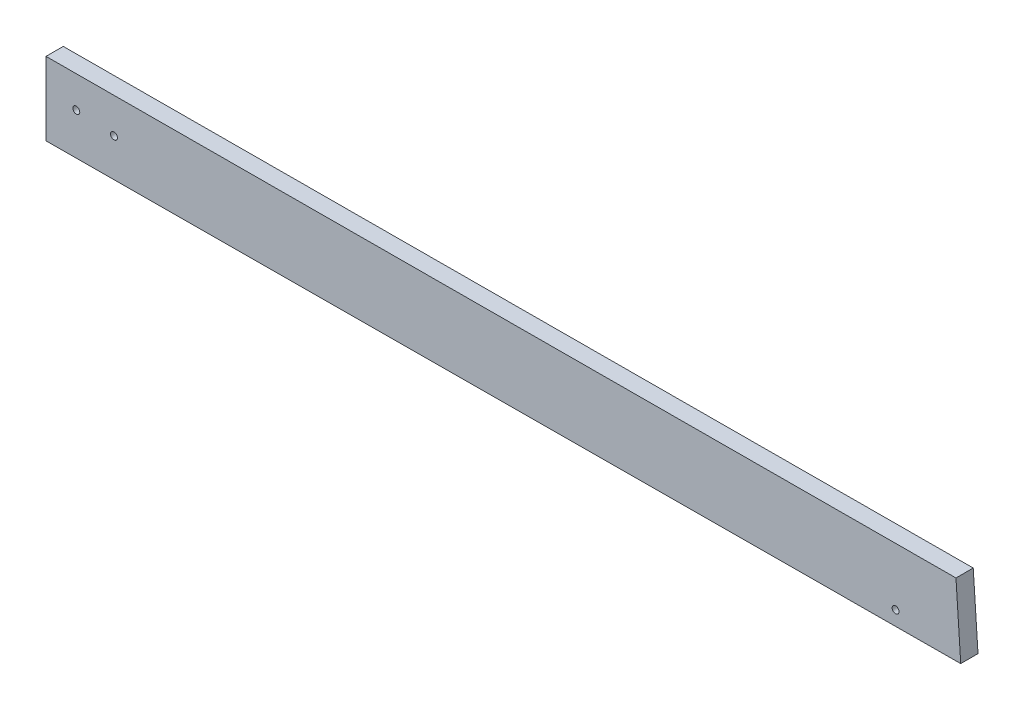
ISO-10303-21;
HEADER;
FILE_DESCRIPTION(('STEP AP214'),'2;1');
FILE_NAME('part.step','',(''),(''),'','','');
FILE_SCHEMA(('AUTOMOTIVE_DESIGN { 1 0 10303 214 1 1 1 1 }'));
ENDSEC;
DATA;
#1=APPLICATION_CONTEXT('core data for automotive mechanical design processes');
#2=APPLICATION_PROTOCOL_DEFINITION('international standard','automotive_design',2000,#1);
#3=PRODUCT_CONTEXT('',#1,'mechanical');
#4=PRODUCT('Part','Part','',(#3));
#5=PRODUCT_RELATED_PRODUCT_CATEGORY('part','',(#4));
#6=PRODUCT_DEFINITION_FORMATION('','',#4);
#7=PRODUCT_DEFINITION_CONTEXT('part definition',#1,'design');
#8=PRODUCT_DEFINITION('design','',#6,#7);
#9=PRODUCT_DEFINITION_SHAPE('','',#8);
#10=(LENGTH_UNIT() NAMED_UNIT(*) SI_UNIT(.MILLI.,.METRE.));
#11=(NAMED_UNIT(*) PLANE_ANGLE_UNIT() SI_UNIT($,.RADIAN.));
#12=(NAMED_UNIT(*) SI_UNIT($,.STERADIAN.) SOLID_ANGLE_UNIT());
#13=UNCERTAINTY_MEASURE_WITH_UNIT(LENGTH_MEASURE(1.E-05),#10,'distance_accuracy_value','');
#14=(GEOMETRIC_REPRESENTATION_CONTEXT(3) GLOBAL_UNCERTAINTY_ASSIGNED_CONTEXT((#13)) GLOBAL_UNIT_ASSIGNED_CONTEXT((#10,
#11,#12)) REPRESENTATION_CONTEXT('',''));
#15=CARTESIAN_POINT('',(0.,0.,0.));
#16=DIRECTION('',(0.,0.,1.));
#17=DIRECTION('',(1.,0.,0.));
#18=AXIS2_PLACEMENT_3D('',#15,#16,#17);
#19=CARTESIAN_POINT('',(-0.640024251142575,125.783223858887,-3.175));
#20=DIRECTION('',(-0.00508824584281917,0.999987054793332,0.));
#21=DIRECTION('',(-0.999987054793332,-0.00508824584281917,0.));
#22=AXIS2_PLACEMENT_3D('',#19,#20,#21);
#23=PLANE('',#22);
#24=DIRECTION('',(-0.999987054793332,-0.00508824584281917,0.));
#25=VECTOR('',#24,1.);
#26=CARTESIAN_POINT('',(-0.640024251142575,125.783223858887,0.));
#27=LINE('',#26,#25);
#28=CARTESIAN_POINT('',(169.876910837737,126.650867176805,0.));
#29=VERTEX_POINT('',#28);
#30=CARTESIAN_POINT('',(1.5875,125.794558196623,0.));
#31=VERTEX_POINT('',#30);
#32=EDGE_CURVE('E111',#29,#31,#27,.T.);
#33=ORIENTED_EDGE('',*,*,#32,.T.);
#34=DIRECTION('',(0.,0.,1.));
#35=VECTOR('',#34,1.);
#36=CARTESIAN_POINT('',(1.5875,125.794558196623,-3.175));
#37=LINE('',#36,#35);
#38=CARTESIAN_POINT('',(1.5875,125.794558196623,-3.175));
#39=VERTEX_POINT('',#38);
#40=EDGE_CURVE('E11',#39,#31,#37,.T.);
#41=ORIENTED_EDGE('',*,*,#40,.F.);
#42=DIRECTION('',(-0.999987054793332,-0.00508824584281917,0.));
#43=VECTOR('',#42,1.);
#44=CARTESIAN_POINT('',(-0.640024251142575,125.783223858887,-3.175));
#45=LINE('',#44,#43);
#46=CARTESIAN_POINT('',(169.876910837737,126.650867176805,-3.175));
#47=VERTEX_POINT('',#46);
#48=EDGE_CURVE('E95',#47,#39,#45,.T.);
#49=ORIENTED_EDGE('',*,*,#48,.F.);
#50=DIRECTION('',(0.,0.,1.));
#51=VECTOR('',#50,1.);
#52=CARTESIAN_POINT('',(169.876910837737,126.650867176805,-3.175));
#53=LINE('',#52,#51);
#54=EDGE_CURVE('E39',#47,#29,#53,.T.);
#55=ORIENTED_EDGE('',*,*,#54,.T.);
#56=EDGE_LOOP('',(#33,#41,#49,#55));
#57=FACE_BOUND('',#56,.T.);
#58=ADVANCED_FACE('F35',(#57),#23,.F.);
#59=CARTESIAN_POINT('',(1.5875,0.,-3.175));
#60=DIRECTION('',(1.,0.,0.));
#61=DIRECTION('',(0.,1.,0.));
#62=AXIS2_PLACEMENT_3D('',#59,#60,#61);
#63=PLANE('',#62);
#64=DIRECTION('',(0.,1.,0.));
#65=VECTOR('',#64,1.);
#66=CARTESIAN_POINT('',(1.5875,0.,0.));
#67=LINE('',#66,#65);
#68=CARTESIAN_POINT('',(1.5875,139.257710065147,0.));
#69=VERTEX_POINT('',#68);
#70=EDGE_CURVE('E67',#31,#69,#67,.T.);
#71=ORIENTED_EDGE('',*,*,#70,.T.);
#72=DIRECTION('',(0.,0.,1.));
#73=VECTOR('',#72,1.);
#74=CARTESIAN_POINT('',(1.5875,139.257710065147,-3.175));
#75=LINE('',#74,#73);
#76=CARTESIAN_POINT('',(1.5875,139.257710065147,-3.175));
#77=VERTEX_POINT('',#76);
#78=EDGE_CURVE('E45',#77,#69,#75,.T.);
#79=ORIENTED_EDGE('',*,*,#78,.F.);
#80=DIRECTION('',(0.,1.,0.));
#81=VECTOR('',#80,1.);
#82=CARTESIAN_POINT('',(1.5875,0.,-3.175));
#83=LINE('',#82,#81);
#84=EDGE_CURVE('E53',#39,#77,#83,.T.);
#85=ORIENTED_EDGE('',*,*,#84,.F.);
#86=ORIENTED_EDGE('',*,*,#40,.T.);
#87=EDGE_LOOP('',(#71,#79,#85,#86));
#88=FACE_BOUND('',#87,.T.);
#89=ADVANCED_FACE('F122',(#88),#63,.F.);
#90=CARTESIAN_POINT('',(-0.499869803452931,139.250216984304,-3.175));
#91=DIRECTION('',(0.00358970056650048,-0.999993557004165,0.));
#92=DIRECTION('',(0.999993557004165,0.00358970056650048,0.));
#93=AXIS2_PLACEMENT_3D('',#90,#91,#92);
#94=PLANE('',#93);
#95=DIRECTION('',(0.999993557004165,0.00358970056650048,0.));
#96=VECTOR('',#95,1.);
#97=CARTESIAN_POINT('',(-0.499869803452931,139.250216984304,0.));
#98=LINE('',#97,#96);
#99=CARTESIAN_POINT('',(169.000191681547,139.858675371333,0.));
#100=VERTEX_POINT('',#99);
#101=EDGE_CURVE('E89',#69,#100,#98,.T.);
#102=ORIENTED_EDGE('',*,*,#101,.T.);
#103=DIRECTION('',(0.,0.,1.));
#104=VECTOR('',#103,1.);
#105=CARTESIAN_POINT('',(169.000191681547,139.858675371333,-3.175));
#106=LINE('',#105,#104);
#107=CARTESIAN_POINT('',(169.000191681547,139.858675371333,-3.175));
#108=VERTEX_POINT('',#107);
#109=EDGE_CURVE('E87',#108,#100,#106,.T.);
#110=ORIENTED_EDGE('',*,*,#109,.F.);
#111=DIRECTION('',(0.999993557004165,0.00358970056650048,0.));
#112=VECTOR('',#111,1.);
#113=CARTESIAN_POINT('',(-0.499869803452931,139.250216984304,-3.175));
#114=LINE('',#113,#112);
#115=EDGE_CURVE('E81',#77,#108,#114,.T.);
#116=ORIENTED_EDGE('',*,*,#115,.F.);
#117=ORIENTED_EDGE('',*,*,#78,.T.);
#118=EDGE_LOOP('',(#102,#110,#116,#117));
#119=FACE_BOUND('',#118,.T.);
#120=ADVANCED_FACE('F88',(#119),#94,.F.);
#121=CARTESIAN_POINT('',(7.16369695098962,133.477415442428,-3.175));
#122=DIRECTION('',(0.,0.,1.));
#123=DIRECTION('',(1.,0.,0.));
#124=AXIS2_PLACEMENT_3D('',#121,#122,#123);
#125=CYLINDRICAL_SURFACE('',#124,0.634999999999996);
#126=CARTESIAN_POINT('',(7.16369695098962,133.477415442428,-3.175));
#127=DIRECTION('',(0.,0.,1.));
#128=DIRECTION('',(1.,0.,0.));
#129=AXIS2_PLACEMENT_3D('',#126,#127,#128);
#130=CIRCLE('',#129,0.634999999999996);
#131=CARTESIAN_POINT('',(7.79869695098961,133.477415442428,-3.175));
#132=VERTEX_POINT('',#131);
#133=EDGE_CURVE('E97',#132,#132,#130,.T.);
#134=ORIENTED_EDGE('',*,*,#133,.F.);
#135=EDGE_LOOP('',(#134));
#136=FACE_BOUND('',#135,.T.);
#137=CARTESIAN_POINT('',(7.16369695098962,133.477415442428,0.));
#138=DIRECTION('',(0.,0.,1.));
#139=DIRECTION('',(1.,0.,0.));
#140=AXIS2_PLACEMENT_3D('',#137,#138,#139);
#141=CIRCLE('',#140,0.634999999999996);
#142=CARTESIAN_POINT('',(7.79869695098961,133.477415442428,0.));
#143=VERTEX_POINT('',#142);
#144=EDGE_CURVE('E108',#143,#143,#141,.T.);
#145=ORIENTED_EDGE('',*,*,#144,.T.);
#146=EDGE_LOOP('',(#145));
#147=FACE_BOUND('',#146,.T.);
#148=ADVANCED_FACE('F129',(#136,#147),#125,.F.);
#149=CARTESIAN_POINT('',(14.0875035769668,132.842415442428,-3.175));
#150=DIRECTION('',(0.,0.,1.));
#151=DIRECTION('',(1.,0.,0.));
#152=AXIS2_PLACEMENT_3D('',#149,#150,#151);
#153=CYLINDRICAL_SURFACE('',#152,0.634999999999992);
#154=CARTESIAN_POINT('',(14.0875035769668,132.842415442428,-3.175));
#155=DIRECTION('',(0.,0.,1.));
#156=DIRECTION('',(1.,0.,0.));
#157=AXIS2_PLACEMENT_3D('',#154,#155,#156);
#158=CIRCLE('',#157,0.634999999999992);
#159=CARTESIAN_POINT('',(14.7225035769667,132.842415442428,-3.175));
#160=VERTEX_POINT('',#159);
#161=EDGE_CURVE('E149',#160,#160,#158,.T.);
#162=ORIENTED_EDGE('',*,*,#161,.F.);
#163=EDGE_LOOP('',(#162));
#164=FACE_BOUND('',#163,.T.);
#165=CARTESIAN_POINT('',(14.0875035769668,132.842415442428,0.));
#166=DIRECTION('',(0.,0.,1.));
#167=DIRECTION('',(1.,0.,0.));
#168=AXIS2_PLACEMENT_3D('',#165,#166,#167);
#169=CIRCLE('',#168,0.634999999999992);
#170=CARTESIAN_POINT('',(14.7225035769667,132.842415442428,0.));
#171=VERTEX_POINT('',#170);
#172=EDGE_CURVE('E105',#171,#171,#169,.T.);
#173=ORIENTED_EDGE('',*,*,#172,.T.);
#174=EDGE_LOOP('',(#173));
#175=FACE_BOUND('',#174,.T.);
#176=ADVANCED_FACE('F138',(#164,#175),#153,.F.);
#177=CARTESIAN_POINT('',(157.892850268766,129.235572602767,-3.175));
#178=DIRECTION('',(0.,0.,1.));
#179=DIRECTION('',(1.,0.,0.));
#180=AXIS2_PLACEMENT_3D('',#177,#178,#179);
#181=CYLINDRICAL_SURFACE('',#180,0.635000000000012);
#182=CARTESIAN_POINT('',(157.892850268766,129.235572602767,-3.175));
#183=DIRECTION('',(0.,0.,1.));
#184=DIRECTION('',(1.,0.,0.));
#185=AXIS2_PLACEMENT_3D('',#182,#183,#184);
#186=CIRCLE('',#185,0.635000000000012);
#187=CARTESIAN_POINT('',(158.527850268766,129.235572602767,-3.175));
#188=VERTEX_POINT('',#187);
#189=EDGE_CURVE('E117',#188,#188,#186,.T.);
#190=ORIENTED_EDGE('',*,*,#189,.F.);
#191=EDGE_LOOP('',(#190));
#192=FACE_BOUND('',#191,.T.);
#193=CARTESIAN_POINT('',(157.892850268766,129.235572602767,0.));
#194=DIRECTION('',(0.,0.,1.));
#195=DIRECTION('',(1.,0.,0.));
#196=AXIS2_PLACEMENT_3D('',#193,#194,#195);
#197=CIRCLE('',#196,0.635000000000012);
#198=CARTESIAN_POINT('',(158.527850268766,129.235572602767,0.));
#199=VERTEX_POINT('',#198);
#200=EDGE_CURVE('E102',#199,#199,#197,.T.);
#201=ORIENTED_EDGE('',*,*,#200,.T.);
#202=EDGE_LOOP('',(#201));
#203=FACE_BOUND('',#202,.T.);
#204=ADVANCED_FACE('F37',(#192,#203),#181,.F.);
#205=CARTESIAN_POINT('',(177.501750398789,11.7823625646208,-3.175));
#206=DIRECTION('',(-0.997804177636263,-0.0662330966482903,0.));
#207=DIRECTION('',(0.0662330966482903,-0.997804177636263,0.));
#208=AXIS2_PLACEMENT_3D('',#205,#206,#207);
#209=PLANE('',#208);
#210=DIRECTION('',(0.0662330966482903,-0.997804177636263,0.));
#211=VECTOR('',#210,1.);
#212=CARTESIAN_POINT('',(177.501750398789,11.7823625646208,0.));
#213=LINE('',#212,#211);
#214=EDGE_CURVE('E114',#100,#29,#213,.T.);
#215=ORIENTED_EDGE('',*,*,#214,.T.);
#216=ORIENTED_EDGE('',*,*,#54,.F.);
#217=DIRECTION('',(0.0662330966482903,-0.997804177636263,0.));
#218=VECTOR('',#217,1.);
#219=CARTESIAN_POINT('',(177.501750398789,11.7823625646208,-3.175));
#220=LINE('',#219,#218);
#221=EDGE_CURVE('E78',#108,#47,#220,.T.);
#222=ORIENTED_EDGE('',*,*,#221,.F.);
#223=ORIENTED_EDGE('',*,*,#109,.T.);
#224=EDGE_LOOP('',(#215,#216,#222,#223));
#225=FACE_BOUND('',#224,.T.);
#226=ADVANCED_FACE('F92',(#225),#209,.F.);
#227=CARTESIAN_POINT('',(0.,0.,-3.175));
#228=DIRECTION('',(0.,0.,1.));
#229=DIRECTION('',(1.,0.,0.));
#230=AXIS2_PLACEMENT_3D('',#227,#228,#229);
#231=PLANE('',#230);
#232=ORIENTED_EDGE('',*,*,#189,.T.);
#233=EDGE_LOOP('',(#232));
#234=FACE_BOUND('',#233,.T.);
#235=ORIENTED_EDGE('',*,*,#161,.T.);
#236=EDGE_LOOP('',(#235));
#237=FACE_BOUND('',#236,.T.);
#238=ORIENTED_EDGE('',*,*,#133,.T.);
#239=EDGE_LOOP('',(#238));
#240=FACE_BOUND('',#239,.T.);
#241=ORIENTED_EDGE('',*,*,#48,.T.);
#242=ORIENTED_EDGE('',*,*,#84,.T.);
#243=ORIENTED_EDGE('',*,*,#115,.T.);
#244=ORIENTED_EDGE('',*,*,#221,.T.);
#245=EDGE_LOOP('',(#241,#242,#243,#244));
#246=FACE_BOUND('',#245,.T.);
#247=ADVANCED_FACE('F83',(#234,#237,#240,#246),#231,.F.);
#248=CARTESIAN_POINT('',(0.,0.,0.));
#249=DIRECTION('',(0.,0.,1.));
#250=DIRECTION('',(1.,0.,0.));
#251=AXIS2_PLACEMENT_3D('',#248,#249,#250);
#252=PLANE('',#251);
#253=ORIENTED_EDGE('',*,*,#200,.F.);
#254=EDGE_LOOP('',(#253));
#255=FACE_BOUND('',#254,.T.);
#256=ORIENTED_EDGE('',*,*,#172,.F.);
#257=EDGE_LOOP('',(#256));
#258=FACE_BOUND('',#257,.T.);
#259=ORIENTED_EDGE('',*,*,#144,.F.);
#260=EDGE_LOOP('',(#259));
#261=FACE_BOUND('',#260,.T.);
#262=ORIENTED_EDGE('',*,*,#32,.F.);
#263=ORIENTED_EDGE('',*,*,#214,.F.);
#264=ORIENTED_EDGE('',*,*,#101,.F.);
#265=ORIENTED_EDGE('',*,*,#70,.F.);
#266=EDGE_LOOP('',(#262,#263,#264,#265));
#267=FACE_BOUND('',#266,.T.);
#268=ADVANCED_FACE('F119',(#255,#258,#261,#267),#252,.T.);
#269=CLOSED_SHELL('',(#58,#89,#120,#148,#176,#204,#226,#247,#268));
#270=MANIFOLD_SOLID_BREP('B2',#269);
#271=ADVANCED_BREP_SHAPE_REPRESENTATION('',(#18,#270),#14);
#272=SHAPE_DEFINITION_REPRESENTATION(#9,#271);
ENDSEC;
END-ISO-10303-21;
